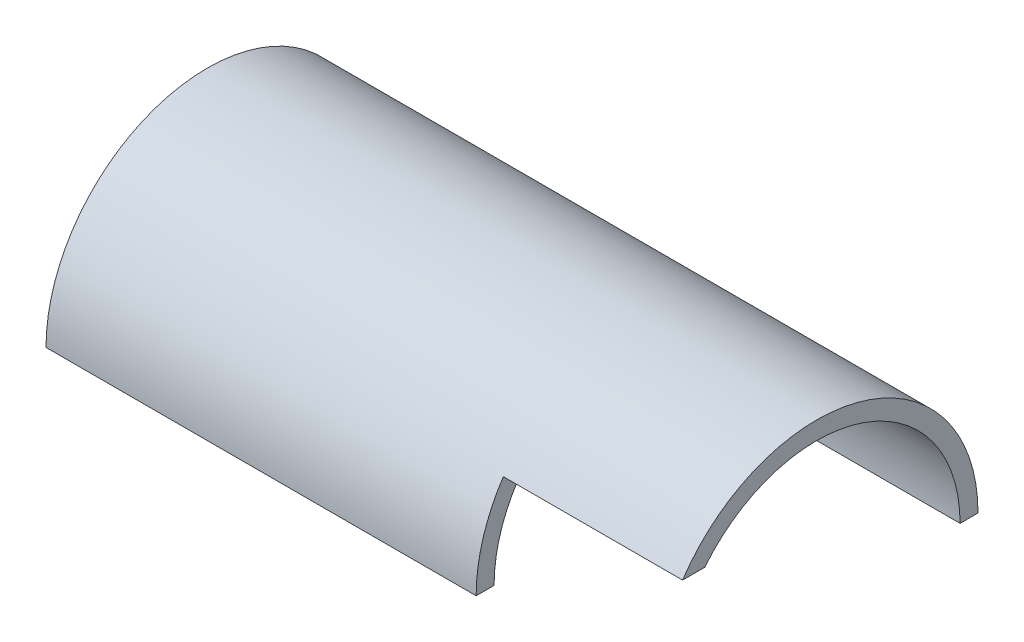
ISO-10303-21;
HEADER;
FILE_DESCRIPTION(('STEP AP214'),'2;1');
FILE_NAME('part.step','',(''),(''),'','','');
FILE_SCHEMA(('AUTOMOTIVE_DESIGN { 1 0 10303 214 1 1 1 1 }'));
ENDSEC;
DATA;
#1=APPLICATION_CONTEXT('core data for automotive mechanical design processes');
#2=APPLICATION_PROTOCOL_DEFINITION('international standard','automotive_design',2000,#1);
#3=PRODUCT_CONTEXT('',#1,'mechanical');
#4=PRODUCT('Part','Part','',(#3));
#5=PRODUCT_RELATED_PRODUCT_CATEGORY('part','',(#4));
#6=PRODUCT_DEFINITION_FORMATION('','',#4);
#7=PRODUCT_DEFINITION_CONTEXT('part definition',#1,'design');
#8=PRODUCT_DEFINITION('design','',#6,#7);
#9=PRODUCT_DEFINITION_SHAPE('','',#8);
#10=(LENGTH_UNIT() NAMED_UNIT(*) SI_UNIT(.MILLI.,.METRE.));
#11=(NAMED_UNIT(*) PLANE_ANGLE_UNIT() SI_UNIT($,.RADIAN.));
#12=(NAMED_UNIT(*) SI_UNIT($,.STERADIAN.) SOLID_ANGLE_UNIT());
#13=UNCERTAINTY_MEASURE_WITH_UNIT(LENGTH_MEASURE(1.E-05),#10,'distance_accuracy_value','');
#14=(GEOMETRIC_REPRESENTATION_CONTEXT(3) GLOBAL_UNCERTAINTY_ASSIGNED_CONTEXT((#13)) GLOBAL_UNIT_ASSIGNED_CONTEXT((#10,
#11,#12)) REPRESENTATION_CONTEXT('',''));
#15=CARTESIAN_POINT('',(0.,0.,0.));
#16=DIRECTION('',(0.,0.,1.));
#17=DIRECTION('',(1.,0.,0.));
#18=AXIS2_PLACEMENT_3D('',#15,#16,#17);
#19=CARTESIAN_POINT('',(-107.95,0.,31.75));
#20=DIRECTION('',(0.,-1.,0.));
#21=DIRECTION('',(0.,0.,-1.));
#22=AXIS2_PLACEMENT_3D('',#19,#20,#21);
#23=PLANE('',#22);
#24=DIRECTION('',(0.,0.,-1.));
#25=VECTOR('',#24,1.);
#26=CARTESIAN_POINT('',(-31.75,0.,127.));
#27=LINE('',#26,#25);
#28=CARTESIAN_POINT('',(-31.75,0.,28.575));
#29=VERTEX_POINT('',#28);
#30=CARTESIAN_POINT('',(-31.75,0.,25.4));
#31=VERTEX_POINT('',#30);
#32=EDGE_CURVE('E124',#29,#31,#27,.T.);
#33=ORIENTED_EDGE('',*,*,#32,.F.);
#34=DIRECTION('',(-1.,0.,0.));
#35=VECTOR('',#34,1.);
#36=CARTESIAN_POINT('',(0.,0.,28.575));
#37=LINE('',#36,#35);
#38=CARTESIAN_POINT('',(-107.95,0.,28.575));
#39=VERTEX_POINT('',#38);
#40=EDGE_CURVE('E130',#29,#39,#37,.T.);
#41=ORIENTED_EDGE('',*,*,#40,.T.);
#42=DIRECTION('',(0.,0.,-1.));
#43=VECTOR('',#42,1.);
#44=CARTESIAN_POINT('',(-107.95,0.,31.75));
#45=LINE('',#44,#43);
#46=CARTESIAN_POINT('',(-107.95,0.,25.4));
#47=VERTEX_POINT('',#46);
#48=EDGE_CURVE('E111',#39,#47,#45,.T.);
#49=ORIENTED_EDGE('',*,*,#48,.T.);
#50=DIRECTION('',(1.,0.,0.));
#51=VECTOR('',#50,1.);
#52=CARTESIAN_POINT('',(-107.95,0.,25.4));
#53=LINE('',#52,#51);
#54=EDGE_CURVE('E104',#47,#31,#53,.T.);
#55=ORIENTED_EDGE('',*,*,#54,.T.);
#56=EDGE_LOOP('',(#33,#41,#49,#55));
#57=FACE_BOUND('',#56,.T.);
#58=ADVANCED_FACE('F39',(#57),#23,.T.);
#59=CARTESIAN_POINT('',(0.,0.,0.));
#60=DIRECTION('',(-1.,0.,0.));
#61=DIRECTION('',(0.,0.,1.));
#62=AXIS2_PLACEMENT_3D('',#59,#60,#61);
#63=PLANE('',#62);
#64=CARTESIAN_POINT('',(0.,0.,0.));
#65=DIRECTION('',(-1.,0.,0.));
#66=DIRECTION('',(0.,0.,1.));
#67=AXIS2_PLACEMENT_3D('',#64,#65,#66);
#68=CIRCLE('',#67,28.575);
#69=CARTESIAN_POINT('',(0.,15.875,23.7595244060145));
#70=VERTEX_POINT('',#69);
#71=CARTESIAN_POINT('',(0.,0.,-28.575));
#72=VERTEX_POINT('',#71);
#73=EDGE_CURVE('E90',#70,#72,#68,.T.);
#74=ORIENTED_EDGE('',*,*,#73,.F.);
#75=DIRECTION('',(0.,0.,1.));
#76=VECTOR('',#75,1.);
#77=CARTESIAN_POINT('',(0.,15.875,0.));
#78=LINE('',#77,#76);
#79=CARTESIAN_POINT('',(0.,15.875,19.8278686449149));
#80=VERTEX_POINT('',#79);
#81=EDGE_CURVE('E46',#80,#70,#78,.T.);
#82=ORIENTED_EDGE('',*,*,#81,.F.);
#83=CARTESIAN_POINT('',(0.,0.,0.));
#84=DIRECTION('',(-1.,0.,0.));
#85=DIRECTION('',(0.,0.,1.));
#86=AXIS2_PLACEMENT_3D('',#83,#84,#85);
#87=CIRCLE('',#86,25.4);
#88=CARTESIAN_POINT('',(0.,0.,-25.4));
#89=VERTEX_POINT('',#88);
#90=EDGE_CURVE('E112',#80,#89,#87,.T.);
#91=ORIENTED_EDGE('',*,*,#90,.T.);
#92=DIRECTION('',(0.,0.,-1.));
#93=VECTOR('',#92,1.);
#94=CARTESIAN_POINT('',(0.,0.,-25.4));
#95=LINE('',#94,#93);
#96=EDGE_CURVE('E98',#89,#72,#95,.T.);
#97=ORIENTED_EDGE('',*,*,#96,.T.);
#98=EDGE_LOOP('',(#74,#82,#91,#97));
#99=FACE_BOUND('',#98,.T.);
#100=ADVANCED_FACE('F95',(#99),#63,.F.);
#101=CARTESIAN_POINT('',(-107.95,0.,-25.4));
#102=DIRECTION('',(0.,-1.,0.));
#103=DIRECTION('',(0.,0.,-1.));
#104=AXIS2_PLACEMENT_3D('',#101,#102,#103);
#105=PLANE('',#104);
#106=DIRECTION('',(0.,0.,-1.));
#107=VECTOR('',#106,1.);
#108=CARTESIAN_POINT('',(-107.95,0.,-25.4));
#109=LINE('',#108,#107);
#110=CARTESIAN_POINT('',(-107.95,0.,-25.4));
#111=VERTEX_POINT('',#110);
#112=CARTESIAN_POINT('',(-107.95,0.,-28.575));
#113=VERTEX_POINT('',#112);
#114=EDGE_CURVE('E108',#111,#113,#109,.T.);
#115=ORIENTED_EDGE('',*,*,#114,.T.);
#116=DIRECTION('',(-1.,0.,0.));
#117=VECTOR('',#116,1.);
#118=CARTESIAN_POINT('',(0.,0.,-28.575));
#119=LINE('',#118,#117);
#120=EDGE_CURVE('E128',#113,#72,#119,.F.);
#121=ORIENTED_EDGE('',*,*,#120,.T.);
#122=ORIENTED_EDGE('',*,*,#96,.F.);
#123=DIRECTION('',(1.,0.,0.));
#124=VECTOR('',#123,1.);
#125=CARTESIAN_POINT('',(-107.95,0.,-25.4));
#126=LINE('',#125,#124);
#127=EDGE_CURVE('E102',#111,#89,#126,.T.);
#128=ORIENTED_EDGE('',*,*,#127,.F.);
#129=EDGE_LOOP('',(#115,#121,#122,#128));
#130=FACE_BOUND('',#129,.T.);
#131=ADVANCED_FACE('F141',(#130),#105,.T.);
#132=CARTESIAN_POINT('',(-107.95,0.,0.));
#133=DIRECTION('',(-1.,0.,0.));
#134=DIRECTION('',(0.,0.,1.));
#135=AXIS2_PLACEMENT_3D('',#132,#133,#134);
#136=PLANE('',#135);
#137=ORIENTED_EDGE('',*,*,#48,.F.);
#138=CARTESIAN_POINT('',(-107.95,0.,0.));
#139=DIRECTION('',(-1.,0.,0.));
#140=DIRECTION('',(0.,0.,1.));
#141=AXIS2_PLACEMENT_3D('',#138,#139,#140);
#142=CIRCLE('',#141,28.575);
#143=EDGE_CURVE('E99',#39,#113,#142,.T.);
#144=ORIENTED_EDGE('',*,*,#143,.T.);
#145=ORIENTED_EDGE('',*,*,#114,.F.);
#146=CARTESIAN_POINT('',(-107.95,0.,0.));
#147=DIRECTION('',(-1.,0.,0.));
#148=DIRECTION('',(0.,0.,1.));
#149=AXIS2_PLACEMENT_3D('',#146,#147,#148);
#150=CIRCLE('',#149,25.4);
#151=EDGE_CURVE('E117',#47,#111,#150,.T.);
#152=ORIENTED_EDGE('',*,*,#151,.F.);
#153=EDGE_LOOP('',(#137,#144,#145,#152));
#154=FACE_BOUND('',#153,.T.);
#155=ADVANCED_FACE('F138',(#154),#136,.T.);
#156=CARTESIAN_POINT('',(-31.75,0.,127.));
#157=DIRECTION('',(1.,0.,0.));
#158=DIRECTION('',(0.,0.,-1.));
#159=AXIS2_PLACEMENT_3D('',#156,#157,#158);
#160=PLANE('',#159);
#161=DIRECTION('',(0.,0.,-1.));
#162=VECTOR('',#161,1.);
#163=CARTESIAN_POINT('',(-31.75,15.875,127.));
#164=LINE('',#163,#162);
#165=CARTESIAN_POINT('',(-31.75,15.875,23.7595244060145));
#166=VERTEX_POINT('',#165);
#167=CARTESIAN_POINT('',(-31.75,15.875,19.8278686449149));
#168=VERTEX_POINT('',#167);
#169=EDGE_CURVE('E126',#166,#168,#164,.T.);
#170=ORIENTED_EDGE('',*,*,#169,.F.);
#171=CARTESIAN_POINT('',(-31.75,0.,0.));
#172=DIRECTION('',(1.,0.,0.));
#173=DIRECTION('',(0.,0.,-1.));
#174=AXIS2_PLACEMENT_3D('',#171,#172,#173);
#175=CIRCLE('',#174,28.575);
#176=EDGE_CURVE('E53',#166,#29,#175,.T.);
#177=ORIENTED_EDGE('',*,*,#176,.T.);
#178=ORIENTED_EDGE('',*,*,#32,.T.);
#179=CARTESIAN_POINT('',(-31.75,0.,0.));
#180=DIRECTION('',(1.,0.,0.));
#181=DIRECTION('',(0.,0.,-1.));
#182=AXIS2_PLACEMENT_3D('',#179,#180,#181);
#183=CIRCLE('',#182,25.4);
#184=EDGE_CURVE('E114',#168,#31,#183,.T.);
#185=ORIENTED_EDGE('',*,*,#184,.F.);
#186=EDGE_LOOP('',(#170,#177,#178,#185));
#187=FACE_BOUND('',#186,.T.);
#188=ADVANCED_FACE('F149',(#187),#160,.T.);
#189=CARTESIAN_POINT('',(-31.75,15.875,127.));
#190=DIRECTION('',(0.,-1.,0.));
#191=DIRECTION('',(0.,0.,-1.));
#192=AXIS2_PLACEMENT_3D('',#189,#190,#191);
#193=PLANE('',#192);
#194=ORIENTED_EDGE('',*,*,#81,.T.);
#195=DIRECTION('',(-1.,0.,0.));
#196=VECTOR('',#195,1.);
#197=CARTESIAN_POINT('',(0.,15.875,23.7595244060145));
#198=LINE('',#197,#196);
#199=EDGE_CURVE('E12',#70,#166,#198,.T.);
#200=ORIENTED_EDGE('',*,*,#199,.T.);
#201=ORIENTED_EDGE('',*,*,#169,.T.);
#202=DIRECTION('',(1.,0.,0.));
#203=VECTOR('',#202,1.);
#204=CARTESIAN_POINT('',(-107.95,15.875,19.8278686449149));
#205=LINE('',#204,#203);
#206=EDGE_CURVE('E60',#80,#168,#205,.F.);
#207=ORIENTED_EDGE('',*,*,#206,.F.);
#208=EDGE_LOOP('',(#194,#200,#201,#207));
#209=FACE_BOUND('',#208,.T.);
#210=ADVANCED_FACE('F101',(#209),#193,.T.);
#211=CARTESIAN_POINT('',(-107.95,0.,0.));
#212=DIRECTION('',(1.,0.,0.));
#213=DIRECTION('',(0.,0.,-1.));
#214=AXIS2_PLACEMENT_3D('',#211,#212,#213);
#215=CYLINDRICAL_SURFACE('',#214,25.4);
#216=ORIENTED_EDGE('',*,*,#206,.T.);
#217=ORIENTED_EDGE('',*,*,#184,.T.);
#218=ORIENTED_EDGE('',*,*,#54,.F.);
#219=ORIENTED_EDGE('',*,*,#151,.T.);
#220=ORIENTED_EDGE('',*,*,#127,.T.);
#221=ORIENTED_EDGE('',*,*,#90,.F.);
#222=EDGE_LOOP('',(#216,#217,#218,#219,#220,#221));
#223=FACE_BOUND('',#222,.T.);
#224=ADVANCED_FACE('F144',(#223),#215,.F.);
#225=CARTESIAN_POINT('',(0.,0.,0.));
#226=DIRECTION('',(-1.,0.,0.));
#227=DIRECTION('',(0.,0.,1.));
#228=AXIS2_PLACEMENT_3D('',#225,#226,#227);
#229=CYLINDRICAL_SURFACE('',#228,28.575);
#230=ORIENTED_EDGE('',*,*,#143,.F.);
#231=ORIENTED_EDGE('',*,*,#40,.F.);
#232=ORIENTED_EDGE('',*,*,#176,.F.);
#233=ORIENTED_EDGE('',*,*,#199,.F.);
#234=ORIENTED_EDGE('',*,*,#73,.T.);
#235=ORIENTED_EDGE('',*,*,#120,.F.);
#236=EDGE_LOOP('',(#230,#231,#232,#233,#234,#235));
#237=FACE_BOUND('',#236,.T.);
#238=ADVANCED_FACE('F89',(#237),#229,.T.);
#239=CLOSED_SHELL('',(#58,#100,#131,#155,#188,#210,#224,#238));
#240=MANIFOLD_SOLID_BREP('B2',#239);
#241=ADVANCED_BREP_SHAPE_REPRESENTATION('',(#18,#240),#14);
#242=SHAPE_DEFINITION_REPRESENTATION(#9,#241);
ENDSEC;
END-ISO-10303-21;
